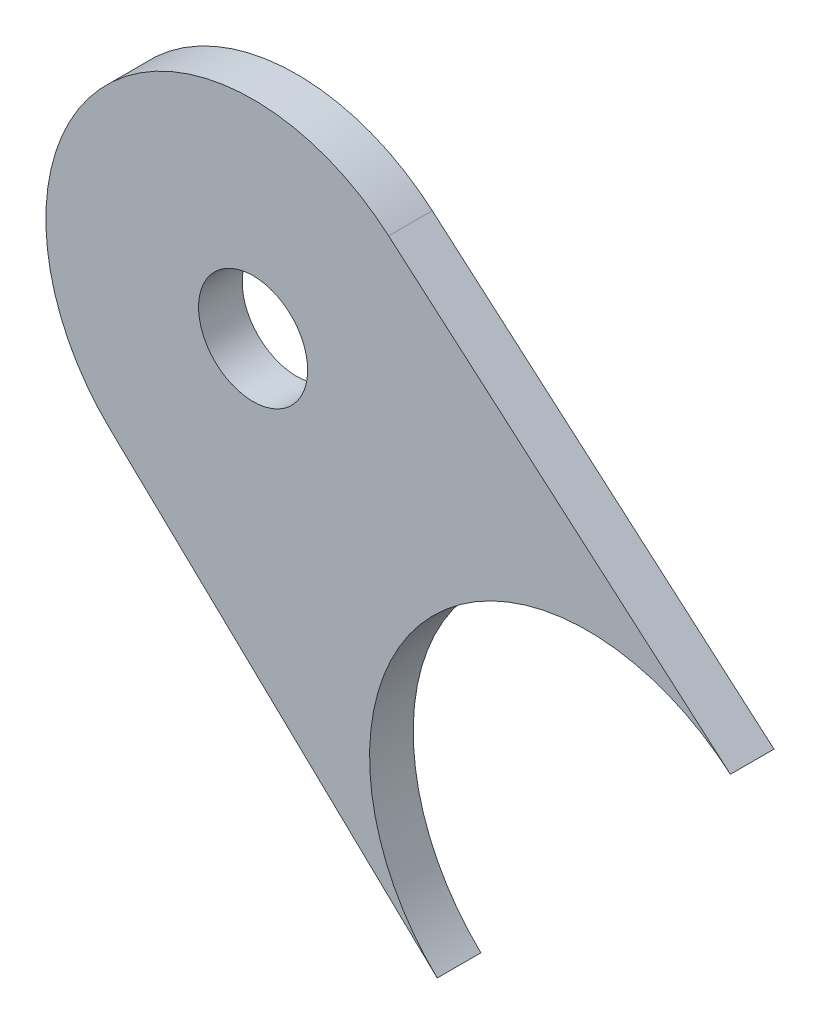
ISO-10303-21;
HEADER;
FILE_DESCRIPTION(('STEP AP214'),'2;1');
FILE_NAME('part.step','',(''),(''),'','','');
FILE_SCHEMA(('AUTOMOTIVE_DESIGN { 1 0 10303 214 1 1 1 1 }'));
ENDSEC;
DATA;
#1=APPLICATION_CONTEXT('core data for automotive mechanical design processes');
#2=APPLICATION_PROTOCOL_DEFINITION('international standard','automotive_design',2000,#1);
#3=PRODUCT_CONTEXT('',#1,'mechanical');
#4=PRODUCT('Part','Part','',(#3));
#5=PRODUCT_RELATED_PRODUCT_CATEGORY('part','',(#4));
#6=PRODUCT_DEFINITION_FORMATION('','',#4);
#7=PRODUCT_DEFINITION_CONTEXT('part definition',#1,'design');
#8=PRODUCT_DEFINITION('design','',#6,#7);
#9=PRODUCT_DEFINITION_SHAPE('','',#8);
#10=(LENGTH_UNIT() NAMED_UNIT(*) SI_UNIT(.MILLI.,.METRE.));
#11=(NAMED_UNIT(*) PLANE_ANGLE_UNIT() SI_UNIT($,.RADIAN.));
#12=(NAMED_UNIT(*) SI_UNIT($,.STERADIAN.) SOLID_ANGLE_UNIT());
#13=UNCERTAINTY_MEASURE_WITH_UNIT(LENGTH_MEASURE(1.E-05),#10,'distance_accuracy_value','');
#14=(GEOMETRIC_REPRESENTATION_CONTEXT(3) GLOBAL_UNCERTAINTY_ASSIGNED_CONTEXT((#13)) GLOBAL_UNIT_ASSIGNED_CONTEXT((#10,
#11,#12)) REPRESENTATION_CONTEXT('',''));
#15=CARTESIAN_POINT('',(0.,0.,0.));
#16=DIRECTION('',(0.,0.,1.));
#17=DIRECTION('',(1.,0.,0.));
#18=AXIS2_PLACEMENT_3D('',#15,#16,#17);
#19=CARTESIAN_POINT('',(103.862003689394,-76.2989926092882,7.3025));
#20=DIRECTION('',(0.,0.,-1.));
#21=DIRECTION('',(-1.,0.,0.));
#22=AXIS2_PLACEMENT_3D('',#19,#20,#21);
#23=PLANE('',#22);
#24=CARTESIAN_POINT('',(103.862003689394,-76.2989926092882,7.3025));
#25=DIRECTION('',(0.,0.,1.));
#26=DIRECTION('',(-1.,0.,0.));
#27=AXIS2_PLACEMENT_3D('',#24,#25,#26);
#28=CIRCLE('',#27,12.065);
#29=CARTESIAN_POINT('',(111.752654756232,-67.1720078530066,7.3025));
#30=VERTEX_POINT('',#29);
#31=CARTESIAN_POINT('',(95.5400743671568,-85.0345359441756,7.3025));
#32=VERTEX_POINT('',#31);
#33=EDGE_CURVE('E87',#30,#32,#28,.T.);
#34=ORIENTED_EDGE('',*,*,#33,.T.);
#35=DIRECTION('',(0.724040060910686,-0.689757921445234,0.));
#36=VECTOR('',#35,1.);
#37=CARTESIAN_POINT('',(95.5400743671568,-85.0345359441756,7.3025));
#38=LINE('',#37,#36);
#39=CARTESIAN_POINT('',(114.582474397646,-103.175308773566,7.3025));
#40=VERTEX_POINT('',#39);
#41=EDGE_CURVE('E82',#32,#40,#38,.T.);
#42=ORIENTED_EDGE('',*,*,#41,.T.);
#43=CARTESIAN_POINT('',(123.3424,-93.98,7.3025));
#44=DIRECTION('',(0.,0.,-1.));
#45=DIRECTION('',(-1.,0.,0.));
#46=AXIS2_PLACEMENT_3D('',#43,#44,#45);
#47=CIRCLE('',#46,12.7);
#48=CARTESIAN_POINT('',(131.648348491409,-84.3726476249668,7.3025));
#49=VERTEX_POINT('',#48);
#50=EDGE_CURVE('E85',#40,#49,#47,.T.);
#51=ORIENTED_EDGE('',*,*,#50,.T.);
#52=DIRECTION('',(-0.756484438978995,0.654011692236947,0.));
#53=VECTOR('',#52,1.);
#54=CARTESIAN_POINT('',(111.752654756232,-67.1720078530066,7.3025));
#55=LINE('',#54,#53);
#56=EDGE_CURVE('E52',#49,#30,#55,.T.);
#57=ORIENTED_EDGE('',*,*,#56,.T.);
#58=EDGE_LOOP('',(#34,#42,#51,#57));
#59=FACE_BOUND('',#58,.T.);
#60=CARTESIAN_POINT('',(103.862003689394,-76.2989926092882,7.3025));
#61=DIRECTION('',(0.,0.,1.));
#62=DIRECTION('',(1.,0.,0.));
#63=AXIS2_PLACEMENT_3D('',#60,#61,#62);
#64=CIRCLE('',#63,3.17499999999991);
#65=CARTESIAN_POINT('',(107.037003689393,-76.2989926092882,7.3025));
#66=VERTEX_POINT('',#65);
#67=EDGE_CURVE('E102',#66,#66,#64,.T.);
#68=ORIENTED_EDGE('',*,*,#67,.F.);
#69=EDGE_LOOP('',(#68));
#70=FACE_BOUND('',#69,.T.);
#71=ADVANCED_FACE('F35',(#59,#70),#23,.F.);
#72=CARTESIAN_POINT('',(103.862003689394,-76.2989926092882,4.7625));
#73=DIRECTION('',(0.,0.,-1.));
#74=DIRECTION('',(-1.,0.,0.));
#75=AXIS2_PLACEMENT_3D('',#72,#73,#74);
#76=PLANE('',#75);
#77=CARTESIAN_POINT('',(103.862003689394,-76.2989926092882,4.7625));
#78=DIRECTION('',(0.,0.,1.));
#79=DIRECTION('',(-1.,0.,0.));
#80=AXIS2_PLACEMENT_3D('',#77,#78,#79);
#81=CIRCLE('',#80,12.065);
#82=CARTESIAN_POINT('',(111.752654756232,-67.1720078530066,4.7625));
#83=VERTEX_POINT('',#82);
#84=CARTESIAN_POINT('',(95.5400743671568,-85.0345359441756,4.7625));
#85=VERTEX_POINT('',#84);
#86=EDGE_CURVE('E99',#83,#85,#81,.T.);
#87=ORIENTED_EDGE('',*,*,#86,.F.);
#88=DIRECTION('',(-0.756484438978995,0.654011692236947,0.));
#89=VECTOR('',#88,1.);
#90=CARTESIAN_POINT('',(111.752654756232,-67.1720078530066,4.7625));
#91=LINE('',#90,#89);
#92=CARTESIAN_POINT('',(131.648348491409,-84.3726476249668,4.7625));
#93=VERTEX_POINT('',#92);
#94=EDGE_CURVE('E75',#93,#83,#91,.T.);
#95=ORIENTED_EDGE('',*,*,#94,.F.);
#96=CARTESIAN_POINT('',(123.3424,-93.98,4.7625));
#97=DIRECTION('',(0.,0.,-1.));
#98=DIRECTION('',(-1.,0.,0.));
#99=AXIS2_PLACEMENT_3D('',#96,#97,#98);
#100=CIRCLE('',#99,12.7);
#101=CARTESIAN_POINT('',(114.582474397646,-103.175308773566,4.7625));
#102=VERTEX_POINT('',#101);
#103=EDGE_CURVE('E69',#102,#93,#100,.T.);
#104=ORIENTED_EDGE('',*,*,#103,.F.);
#105=DIRECTION('',(0.724040060910686,-0.689757921445234,0.));
#106=VECTOR('',#105,1.);
#107=CARTESIAN_POINT('',(95.5400743671568,-85.0345359441756,4.7625));
#108=LINE('',#107,#106);
#109=EDGE_CURVE('E91',#85,#102,#108,.T.);
#110=ORIENTED_EDGE('',*,*,#109,.F.);
#111=EDGE_LOOP('',(#87,#95,#104,#110));
#112=FACE_BOUND('',#111,.T.);
#113=CARTESIAN_POINT('',(103.862003689394,-76.2989926092882,4.7625));
#114=DIRECTION('',(0.,0.,1.));
#115=DIRECTION('',(1.,0.,0.));
#116=AXIS2_PLACEMENT_3D('',#113,#114,#115);
#117=CIRCLE('',#116,3.17499999999991);
#118=CARTESIAN_POINT('',(107.037003689393,-76.2989926092882,4.7625));
#119=VERTEX_POINT('',#118);
#120=EDGE_CURVE('E114',#119,#119,#117,.T.);
#121=ORIENTED_EDGE('',*,*,#120,.T.);
#122=EDGE_LOOP('',(#121));
#123=FACE_BOUND('',#122,.T.);
#124=ADVANCED_FACE('F110',(#112,#123),#76,.T.);
#125=CARTESIAN_POINT('',(103.862003689394,-76.2989926092882,7.3025));
#126=DIRECTION('',(0.,0.,-1.));
#127=DIRECTION('',(-1.,0.,0.));
#128=AXIS2_PLACEMENT_3D('',#125,#126,#127);
#129=CYLINDRICAL_SURFACE('',#128,12.065);
#130=ORIENTED_EDGE('',*,*,#86,.T.);
#131=DIRECTION('',(0.,0.,-1.));
#132=VECTOR('',#131,1.);
#133=CARTESIAN_POINT('',(95.5400743671568,-85.0345359441756,7.3025));
#134=LINE('',#133,#132);
#135=EDGE_CURVE('E11',#32,#85,#134,.T.);
#136=ORIENTED_EDGE('',*,*,#135,.F.);
#137=ORIENTED_EDGE('',*,*,#33,.F.);
#138=DIRECTION('',(0.,0.,-1.));
#139=VECTOR('',#138,1.);
#140=CARTESIAN_POINT('',(111.752654756232,-67.1720078530066,7.3025));
#141=LINE('',#140,#139);
#142=EDGE_CURVE('E95',#30,#83,#141,.T.);
#143=ORIENTED_EDGE('',*,*,#142,.T.);
#144=EDGE_LOOP('',(#130,#136,#137,#143));
#145=FACE_BOUND('',#144,.T.);
#146=ADVANCED_FACE('F37',(#145),#129,.T.);
#147=CARTESIAN_POINT('',(95.5400743671568,-85.0345359441756,7.3025));
#148=DIRECTION('',(0.689757921445234,0.724040060910686,0.));
#149=DIRECTION('',(-0.724040060910686,0.689757921445234,0.));
#150=AXIS2_PLACEMENT_3D('',#147,#148,#149);
#151=PLANE('',#150);
#152=ORIENTED_EDGE('',*,*,#109,.T.);
#153=DIRECTION('',(0.,0.,-1.));
#154=VECTOR('',#153,1.);
#155=CARTESIAN_POINT('',(114.582474397646,-103.175308773566,7.3025));
#156=LINE('',#155,#154);
#157=EDGE_CURVE('E44',#40,#102,#156,.T.);
#158=ORIENTED_EDGE('',*,*,#157,.F.);
#159=ORIENTED_EDGE('',*,*,#41,.F.);
#160=ORIENTED_EDGE('',*,*,#135,.T.);
#161=EDGE_LOOP('',(#152,#158,#159,#160));
#162=FACE_BOUND('',#161,.T.);
#163=ADVANCED_FACE('F90',(#162),#151,.F.);
#164=CARTESIAN_POINT('',(123.3424,-93.98,7.3025));
#165=DIRECTION('',(0.,0.,-1.));
#166=DIRECTION('',(-1.,0.,0.));
#167=AXIS2_PLACEMENT_3D('',#164,#165,#166);
#168=CYLINDRICAL_SURFACE('',#167,12.7);
#169=ORIENTED_EDGE('',*,*,#103,.T.);
#170=DIRECTION('',(0.,0.,-1.));
#171=VECTOR('',#170,1.);
#172=CARTESIAN_POINT('',(131.648348491409,-84.3726476249668,7.3025));
#173=LINE('',#172,#171);
#174=EDGE_CURVE('E92',#49,#93,#173,.T.);
#175=ORIENTED_EDGE('',*,*,#174,.F.);
#176=ORIENTED_EDGE('',*,*,#50,.F.);
#177=ORIENTED_EDGE('',*,*,#157,.T.);
#178=EDGE_LOOP('',(#169,#175,#176,#177));
#179=FACE_BOUND('',#178,.T.);
#180=ADVANCED_FACE('F93',(#179),#168,.F.);
#181=CARTESIAN_POINT('',(111.752654756232,-67.1720078530066,7.3025));
#182=DIRECTION('',(-0.654011692236947,-0.756484438978995,0.));
#183=DIRECTION('',(0.756484438978995,-0.654011692236947,0.));
#184=AXIS2_PLACEMENT_3D('',#181,#182,#183);
#185=PLANE('',#184);
#186=ORIENTED_EDGE('',*,*,#94,.T.);
#187=ORIENTED_EDGE('',*,*,#142,.F.);
#188=ORIENTED_EDGE('',*,*,#56,.F.);
#189=ORIENTED_EDGE('',*,*,#174,.T.);
#190=EDGE_LOOP('',(#186,#187,#188,#189));
#191=FACE_BOUND('',#190,.T.);
#192=ADVANCED_FACE('F107',(#191),#185,.F.);
#193=CARTESIAN_POINT('',(103.862003689394,-76.2989926092882,7.3025));
#194=DIRECTION('',(0.,0.,-1.));
#195=DIRECTION('',(-1.,0.,0.));
#196=AXIS2_PLACEMENT_3D('',#193,#194,#195);
#197=CYLINDRICAL_SURFACE('',#196,3.17499999999991);
#198=ORIENTED_EDGE('',*,*,#67,.T.);
#199=EDGE_LOOP('',(#198));
#200=FACE_BOUND('',#199,.T.);
#201=ORIENTED_EDGE('',*,*,#120,.F.);
#202=EDGE_LOOP('',(#201));
#203=FACE_BOUND('',#202,.T.);
#204=ADVANCED_FACE('F120',(#200,#203),#197,.F.);
#205=CLOSED_SHELL('',(#71,#124,#146,#163,#180,#192,#204));
#206=MANIFOLD_SOLID_BREP('B2',#205);
#207=ADVANCED_BREP_SHAPE_REPRESENTATION('',(#18,#206),#14);
#208=SHAPE_DEFINITION_REPRESENTATION(#9,#207);
ENDSEC;
END-ISO-10303-21;
